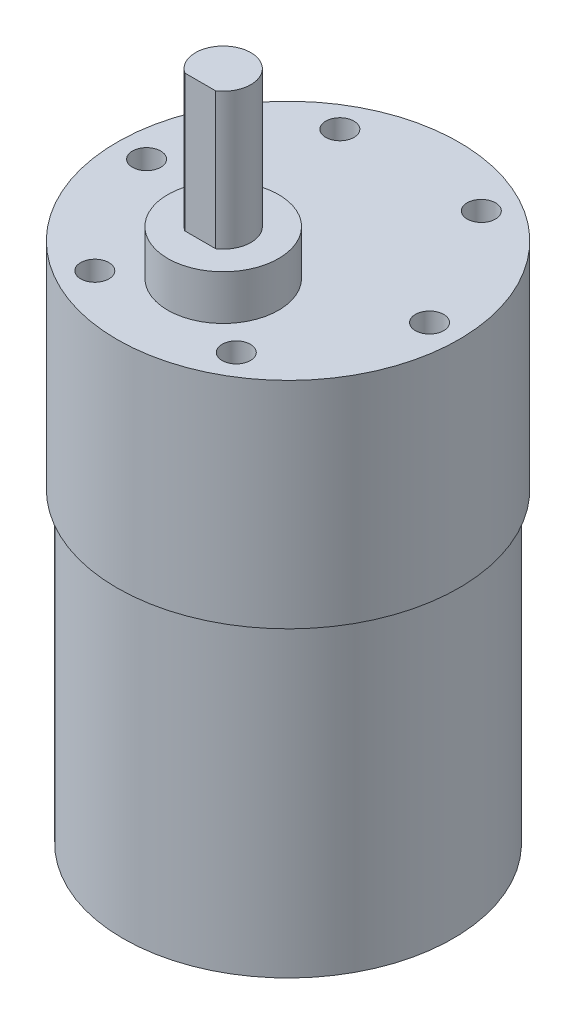
ISO-10303-21;
HEADER;
FILE_DESCRIPTION(('STEP AP214'),'2;1');
FILE_NAME('part.step','',(''),(''),'','','');
FILE_SCHEMA(('AUTOMOTIVE_DESIGN { 1 0 10303 214 1 1 1 1 }'));
ENDSEC;
DATA;
#1=APPLICATION_CONTEXT('core data for automotive mechanical design processes');
#2=APPLICATION_PROTOCOL_DEFINITION('international standard','automotive_design',2000,#1);
#3=PRODUCT_CONTEXT('',#1,'mechanical');
#4=PRODUCT('Part','Part','',(#3));
#5=PRODUCT_RELATED_PRODUCT_CATEGORY('part','',(#4));
#6=PRODUCT_DEFINITION_FORMATION('','',#4);
#7=PRODUCT_DEFINITION_CONTEXT('part definition',#1,'design');
#8=PRODUCT_DEFINITION('design','',#6,#7);
#9=PRODUCT_DEFINITION_SHAPE('','',#8);
#10=(LENGTH_UNIT() NAMED_UNIT(*) SI_UNIT(.MILLI.,.METRE.));
#11=(NAMED_UNIT(*) PLANE_ANGLE_UNIT() SI_UNIT($,.RADIAN.));
#12=(NAMED_UNIT(*) SI_UNIT($,.STERADIAN.) SOLID_ANGLE_UNIT());
#13=UNCERTAINTY_MEASURE_WITH_UNIT(LENGTH_MEASURE(1.E-05),#10,'distance_accuracy_value','');
#14=(GEOMETRIC_REPRESENTATION_CONTEXT(3) GLOBAL_UNCERTAINTY_ASSIGNED_CONTEXT((#13)) GLOBAL_UNIT_ASSIGNED_CONTEXT((#10,
#11,#12)) REPRESENTATION_CONTEXT('',''));
#15=CARTESIAN_POINT('',(0.,0.,0.));
#16=DIRECTION('',(0.,0.,1.));
#17=DIRECTION('',(1.,0.,0.));
#18=AXIS2_PLACEMENT_3D('',#15,#16,#17);
#19=CARTESIAN_POINT('',(0.,61.0235,6.985));
#20=DIRECTION('',(0.,1.,0.));
#21=DIRECTION('',(0.,0.,1.));
#22=AXIS2_PLACEMENT_3D('',#19,#20,#21);
#23=PLANE('',#22);
#24=CARTESIAN_POINT('',(0.,61.0235,6.985));
#25=DIRECTION('',(0.,1.,0.));
#26=DIRECTION('',(0.,0.,1.));
#27=AXIS2_PLACEMENT_3D('',#24,#25,#26);
#28=CIRCLE('',#27,5.969);
#29=CARTESIAN_POINT('',(0.,61.0235,12.954));
#30=VERTEX_POINT('',#29);
#31=EDGE_CURVE('E80',#30,#30,#28,.T.);
#32=ORIENTED_EDGE('',*,*,#31,.T.);
#33=EDGE_LOOP('',(#32));
#34=FACE_BOUND('',#33,.T.);
#35=CARTESIAN_POINT('',(0.,61.0235,6.985));
#36=DIRECTION('',(0.,1.,0.));
#37=DIRECTION('',(0.,0.,1.));
#38=AXIS2_PLACEMENT_3D('',#35,#36,#37);
#39=CIRCLE('',#38,2.9845);
#40=CARTESIAN_POINT('',(1.66558938517271,61.0235,9.4615));
#41=VERTEX_POINT('',#40);
#42=CARTESIAN_POINT('',(-1.66558938517271,61.0235,9.4615));
#43=VERTEX_POINT('',#42);
#44=EDGE_CURVE('E48',#41,#43,#39,.T.);
#45=ORIENTED_EDGE('',*,*,#44,.F.);
#46=DIRECTION('',(-1.,0.,0.));
#47=VECTOR('',#46,1.);
#48=CARTESIAN_POINT('',(0.,61.0235,9.4615));
#49=LINE('',#48,#47);
#50=EDGE_CURVE('E62',#41,#43,#49,.T.);
#51=ORIENTED_EDGE('',*,*,#50,.T.);
#52=EDGE_LOOP('',(#45,#51));
#53=FACE_BOUND('',#52,.T.);
#54=ADVANCED_FACE('F34',(#34,#53),#23,.T.);
#55=CARTESIAN_POINT('',(0.,33.02,0.));
#56=DIRECTION('',(0.,-1.,0.));
#57=DIRECTION('',(0.,0.,-1.));
#58=AXIS2_PLACEMENT_3D('',#55,#56,#57);
#59=CYLINDRICAL_SURFACE('',#58,17.78);
#60=CARTESIAN_POINT('',(0.,33.02,0.));
#61=DIRECTION('',(0.,1.,0.));
#62=DIRECTION('',(0.,0.,1.));
#63=AXIS2_PLACEMENT_3D('',#60,#61,#62);
#64=CIRCLE('',#63,17.78);
#65=CARTESIAN_POINT('',(0.,33.02,17.78));
#66=VERTEX_POINT('',#65);
#67=EDGE_CURVE('E11',#66,#66,#64,.T.);
#68=ORIENTED_EDGE('',*,*,#67,.F.);
#69=EDGE_LOOP('',(#68));
#70=FACE_BOUND('',#69,.T.);
#71=CARTESIAN_POINT('',(0.,0.,0.));
#72=DIRECTION('',(0.,1.,0.));
#73=DIRECTION('',(0.,0.,1.));
#74=AXIS2_PLACEMENT_3D('',#71,#72,#73);
#75=CIRCLE('',#74,17.78);
#76=CARTESIAN_POINT('',(0.,0.,17.78));
#77=VERTEX_POINT('',#76);
#78=EDGE_CURVE('E38',#77,#77,#75,.T.);
#79=ORIENTED_EDGE('',*,*,#78,.T.);
#80=EDGE_LOOP('',(#79));
#81=FACE_BOUND('',#80,.T.);
#82=ADVANCED_FACE('F36',(#70,#81),#59,.T.);
#83=CARTESIAN_POINT('',(0.,0.,0.));
#84=DIRECTION('',(0.,1.,0.));
#85=DIRECTION('',(0.,0.,1.));
#86=AXIS2_PLACEMENT_3D('',#83,#84,#85);
#87=PLANE('',#86);
#88=ORIENTED_EDGE('',*,*,#78,.F.);
#89=EDGE_LOOP('',(#88));
#90=FACE_BOUND('',#89,.T.);
#91=ADVANCED_FACE('F152',(#90),#87,.F.);
#92=CARTESIAN_POINT('',(0.,56.1975,0.));
#93=DIRECTION('',(0.,-1.,0.));
#94=DIRECTION('',(0.,0.,-1.));
#95=AXIS2_PLACEMENT_3D('',#92,#93,#94);
#96=CYLINDRICAL_SURFACE('',#95,18.415);
#97=CARTESIAN_POINT('',(0.,56.1975,0.));
#98=DIRECTION('',(0.,1.,0.));
#99=DIRECTION('',(0.,0.,1.));
#100=AXIS2_PLACEMENT_3D('',#97,#98,#99);
#101=CIRCLE('',#100,18.415);
#102=CARTESIAN_POINT('',(0.,56.1975,18.415));
#103=VERTEX_POINT('',#102);
#104=EDGE_CURVE('E122',#103,#103,#101,.T.);
#105=ORIENTED_EDGE('',*,*,#104,.F.);
#106=EDGE_LOOP('',(#105));
#107=FACE_BOUND('',#106,.T.);
#108=CARTESIAN_POINT('',(0.,33.02,0.));
#109=DIRECTION('',(0.,1.,0.));
#110=DIRECTION('',(0.,0.,1.));
#111=AXIS2_PLACEMENT_3D('',#108,#109,#110);
#112=CIRCLE('',#111,18.415);
#113=CARTESIAN_POINT('',(0.,33.02,18.415));
#114=VERTEX_POINT('',#113);
#115=EDGE_CURVE('E89',#114,#114,#112,.T.);
#116=ORIENTED_EDGE('',*,*,#115,.T.);
#117=EDGE_LOOP('',(#116));
#118=FACE_BOUND('',#117,.T.);
#119=ADVANCED_FACE('F128',(#107,#118),#96,.T.);
#120=CARTESIAN_POINT('',(0.,56.1975,0.));
#121=DIRECTION('',(0.,1.,0.));
#122=DIRECTION('',(0.,0.,1.));
#123=AXIS2_PLACEMENT_3D('',#120,#121,#122);
#124=PLANE('',#123);
#125=CARTESIAN_POINT('',(0.,56.1975,6.985));
#126=DIRECTION('',(0.,1.,0.));
#127=DIRECTION('',(0.,0.,1.));
#128=AXIS2_PLACEMENT_3D('',#125,#126,#127);
#129=CIRCLE('',#128,5.969);
#130=CARTESIAN_POINT('',(0.,56.1975,12.954));
#131=VERTEX_POINT('',#130);
#132=EDGE_CURVE('E79',#131,#131,#129,.T.);
#133=ORIENTED_EDGE('',*,*,#132,.F.);
#134=EDGE_LOOP('',(#133));
#135=FACE_BOUND('',#134,.T.);
#136=CARTESIAN_POINT('',(15.24,56.1975,0.));
#137=DIRECTION('',(0.,1.,0.));
#138=DIRECTION('',(0.,0.,1.));
#139=AXIS2_PLACEMENT_3D('',#136,#137,#138);
#140=CIRCLE('',#139,1.524);
#141=CARTESIAN_POINT('',(15.24,56.1975,1.524));
#142=VERTEX_POINT('',#141);
#143=EDGE_CURVE('E90',#142,#142,#140,.T.);
#144=ORIENTED_EDGE('',*,*,#143,.F.);
#145=EDGE_LOOP('',(#144));
#146=FACE_BOUND('',#145,.T.);
#147=CARTESIAN_POINT('',(7.62000000000015,56.1975,-13.1982271536748));
#148=DIRECTION('',(0.,1.,0.));
#149=DIRECTION('',(0.,0.,1.));
#150=AXIS2_PLACEMENT_3D('',#147,#148,#149);
#151=CIRCLE('',#150,1.524);
#152=CARTESIAN_POINT('',(7.62000000000015,56.1975,-11.6742271536748));
#153=VERTEX_POINT('',#152);
#154=EDGE_CURVE('E83',#153,#153,#151,.T.);
#155=ORIENTED_EDGE('',*,*,#154,.F.);
#156=EDGE_LOOP('',(#155));
#157=FACE_BOUND('',#156,.T.);
#158=CARTESIAN_POINT('',(-7.61999999999988,56.1975,-13.1982271536749));
#159=DIRECTION('',(0.,1.,0.));
#160=DIRECTION('',(0.,0.,1.));
#161=AXIS2_PLACEMENT_3D('',#158,#159,#160);
#162=CIRCLE('',#161,1.524);
#163=CARTESIAN_POINT('',(-7.61999999999988,56.1975,-11.6742271536749));
#164=VERTEX_POINT('',#163);
#165=EDGE_CURVE('E97',#164,#164,#162,.T.);
#166=ORIENTED_EDGE('',*,*,#165,.F.);
#167=EDGE_LOOP('',(#166));
#168=FACE_BOUND('',#167,.T.);
#169=CARTESIAN_POINT('',(-15.24,56.1975,-1.06420351207939E-13));
#170=DIRECTION('',(0.,1.,0.));
#171=DIRECTION('',(0.,0.,1.));
#172=AXIS2_PLACEMENT_3D('',#169,#170,#171);
#173=CIRCLE('',#172,1.524);
#174=CARTESIAN_POINT('',(-15.24,56.1975,1.52399999999989));
#175=VERTEX_POINT('',#174);
#176=EDGE_CURVE('E114',#175,#175,#173,.T.);
#177=ORIENTED_EDGE('',*,*,#176,.F.);
#178=EDGE_LOOP('',(#177));
#179=FACE_BOUND('',#178,.T.);
#180=CARTESIAN_POINT('',(-7.62000000000006,56.1975,13.1982271536748));
#181=DIRECTION('',(0.,1.,0.));
#182=DIRECTION('',(0.,0.,1.));
#183=AXIS2_PLACEMENT_3D('',#180,#181,#182);
#184=CIRCLE('',#183,1.524);
#185=CARTESIAN_POINT('',(-7.62000000000006,56.1975,14.7222271536748));
#186=VERTEX_POINT('',#185);
#187=EDGE_CURVE('E108',#186,#186,#184,.T.);
#188=ORIENTED_EDGE('',*,*,#187,.F.);
#189=EDGE_LOOP('',(#188));
#190=FACE_BOUND('',#189,.T.);
#191=CARTESIAN_POINT('',(7.61999999999997,56.1975,13.1982271536749));
#192=DIRECTION('',(0.,1.,0.));
#193=DIRECTION('',(0.,0.,1.));
#194=AXIS2_PLACEMENT_3D('',#191,#192,#193);
#195=CIRCLE('',#194,1.524);
#196=CARTESIAN_POINT('',(7.61999999999997,56.1975,14.7222271536749));
#197=VERTEX_POINT('',#196);
#198=EDGE_CURVE('E102',#197,#197,#195,.T.);
#199=ORIENTED_EDGE('',*,*,#198,.F.);
#200=EDGE_LOOP('',(#199));
#201=FACE_BOUND('',#200,.T.);
#202=ORIENTED_EDGE('',*,*,#104,.T.);
#203=EDGE_LOOP('',(#202));
#204=FACE_BOUND('',#203,.T.);
#205=ADVANCED_FACE('F133',(#135,#146,#157,#168,#179,#190,#201,#204),#124,.T.);
#206=CARTESIAN_POINT('',(0.,33.02,0.));
#207=DIRECTION('',(0.,1.,0.));
#208=DIRECTION('',(0.,0.,1.));
#209=AXIS2_PLACEMENT_3D('',#206,#207,#208);
#210=PLANE('',#209);
#211=ORIENTED_EDGE('',*,*,#67,.T.);
#212=EDGE_LOOP('',(#211));
#213=FACE_BOUND('',#212,.T.);
#214=ORIENTED_EDGE('',*,*,#115,.F.);
#215=EDGE_LOOP('',(#214));
#216=FACE_BOUND('',#215,.T.);
#217=ADVANCED_FACE('F130',(#213,#216),#210,.F.);
#218=CARTESIAN_POINT('',(7.61999999999997,43.4975,13.1982271536749));
#219=DIRECTION('',(0.,1.,0.));
#220=DIRECTION('',(0.,0.,1.));
#221=AXIS2_PLACEMENT_3D('',#218,#219,#220);
#222=CYLINDRICAL_SURFACE('',#221,1.524);
#223=CARTESIAN_POINT('',(7.61999999999997,43.4975,13.1982271536749));
#224=DIRECTION('',(0.,1.,0.));
#225=DIRECTION('',(0.,0.,1.));
#226=AXIS2_PLACEMENT_3D('',#223,#224,#225);
#227=CIRCLE('',#226,1.524);
#228=CARTESIAN_POINT('',(7.61999999999997,43.4975,14.7222271536749));
#229=VERTEX_POINT('',#228);
#230=EDGE_CURVE('E93',#229,#229,#227,.T.);
#231=ORIENTED_EDGE('',*,*,#230,.F.);
#232=EDGE_LOOP('',(#231));
#233=FACE_BOUND('',#232,.T.);
#234=ORIENTED_EDGE('',*,*,#198,.T.);
#235=EDGE_LOOP('',(#234));
#236=FACE_BOUND('',#235,.T.);
#237=ADVANCED_FACE('F132',(#233,#236),#222,.F.);
#238=CARTESIAN_POINT('',(7.61999999999997,43.4975,13.1982271536749));
#239=DIRECTION('',(0.,1.,0.));
#240=DIRECTION('',(0.,0.,1.));
#241=AXIS2_PLACEMENT_3D('',#238,#239,#240);
#242=PLANE('',#241);
#243=ORIENTED_EDGE('',*,*,#230,.T.);
#244=EDGE_LOOP('',(#243));
#245=FACE_BOUND('',#244,.T.);
#246=ADVANCED_FACE('F140',(#245),#242,.T.);
#247=CARTESIAN_POINT('',(-7.62000000000006,43.4975,13.1982271536748));
#248=DIRECTION('',(0.,1.,0.));
#249=DIRECTION('',(0.,0.,1.));
#250=AXIS2_PLACEMENT_3D('',#247,#248,#249);
#251=CYLINDRICAL_SURFACE('',#250,1.524);
#252=CARTESIAN_POINT('',(-7.62000000000006,43.4975,13.1982271536748));
#253=DIRECTION('',(0.,1.,0.));
#254=DIRECTION('',(0.,0.,1.));
#255=AXIS2_PLACEMENT_3D('',#252,#253,#254);
#256=CIRCLE('',#255,1.524);
#257=CARTESIAN_POINT('',(-7.62000000000006,43.4975,14.7222271536748));
#258=VERTEX_POINT('',#257);
#259=EDGE_CURVE('E105',#258,#258,#256,.T.);
#260=ORIENTED_EDGE('',*,*,#259,.F.);
#261=EDGE_LOOP('',(#260));
#262=FACE_BOUND('',#261,.T.);
#263=ORIENTED_EDGE('',*,*,#187,.T.);
#264=EDGE_LOOP('',(#263));
#265=FACE_BOUND('',#264,.T.);
#266=ADVANCED_FACE('F179',(#262,#265),#251,.F.);
#267=CARTESIAN_POINT('',(-7.62000000000006,43.4975,13.1982271536748));
#268=DIRECTION('',(0.,1.,0.));
#269=DIRECTION('',(0.,0.,1.));
#270=AXIS2_PLACEMENT_3D('',#267,#268,#269);
#271=PLANE('',#270);
#272=ORIENTED_EDGE('',*,*,#259,.T.);
#273=EDGE_LOOP('',(#272));
#274=FACE_BOUND('',#273,.T.);
#275=ADVANCED_FACE('F182',(#274),#271,.T.);
#276=CARTESIAN_POINT('',(-15.24,43.4975,-1.06420351207939E-13));
#277=DIRECTION('',(0.,1.,0.));
#278=DIRECTION('',(0.,0.,1.));
#279=AXIS2_PLACEMENT_3D('',#276,#277,#278);
#280=CYLINDRICAL_SURFACE('',#279,1.524);
#281=CARTESIAN_POINT('',(-15.24,43.4975,-1.06420351207939E-13));
#282=DIRECTION('',(0.,1.,0.));
#283=DIRECTION('',(0.,0.,1.));
#284=AXIS2_PLACEMENT_3D('',#281,#282,#283);
#285=CIRCLE('',#284,1.524);
#286=CARTESIAN_POINT('',(-15.24,43.4975,1.52399999999989));
#287=VERTEX_POINT('',#286);
#288=EDGE_CURVE('E111',#287,#287,#285,.T.);
#289=ORIENTED_EDGE('',*,*,#288,.F.);
#290=EDGE_LOOP('',(#289));
#291=FACE_BOUND('',#290,.T.);
#292=ORIENTED_EDGE('',*,*,#176,.T.);
#293=EDGE_LOOP('',(#292));
#294=FACE_BOUND('',#293,.T.);
#295=ADVANCED_FACE('F185',(#291,#294),#280,.F.);
#296=CARTESIAN_POINT('',(-15.24,43.4975,-1.06420351207939E-13));
#297=DIRECTION('',(0.,1.,0.));
#298=DIRECTION('',(0.,0.,1.));
#299=AXIS2_PLACEMENT_3D('',#296,#297,#298);
#300=PLANE('',#299);
#301=ORIENTED_EDGE('',*,*,#288,.T.);
#302=EDGE_LOOP('',(#301));
#303=FACE_BOUND('',#302,.T.);
#304=ADVANCED_FACE('F190',(#303),#300,.T.);
#305=CARTESIAN_POINT('',(-7.61999999999988,43.4975,-13.1982271536749));
#306=DIRECTION('',(0.,1.,0.));
#307=DIRECTION('',(0.,0.,1.));
#308=AXIS2_PLACEMENT_3D('',#305,#306,#307);
#309=CYLINDRICAL_SURFACE('',#308,1.524);
#310=CARTESIAN_POINT('',(-7.61999999999988,43.4975,-13.1982271536749));
#311=DIRECTION('',(0.,1.,0.));
#312=DIRECTION('',(0.,0.,1.));
#313=AXIS2_PLACEMENT_3D('',#310,#311,#312);
#314=CIRCLE('',#313,1.524);
#315=CARTESIAN_POINT('',(-7.61999999999988,43.4975,-11.6742271536749));
#316=VERTEX_POINT('',#315);
#317=EDGE_CURVE('E117',#316,#316,#314,.T.);
#318=ORIENTED_EDGE('',*,*,#317,.F.);
#319=EDGE_LOOP('',(#318));
#320=FACE_BOUND('',#319,.T.);
#321=ORIENTED_EDGE('',*,*,#165,.T.);
#322=EDGE_LOOP('',(#321));
#323=FACE_BOUND('',#322,.T.);
#324=ADVANCED_FACE('F193',(#320,#323),#309,.F.);
#325=CARTESIAN_POINT('',(-7.61999999999988,43.4975,-13.1982271536749));
#326=DIRECTION('',(0.,1.,0.));
#327=DIRECTION('',(0.,0.,1.));
#328=AXIS2_PLACEMENT_3D('',#325,#326,#327);
#329=PLANE('',#328);
#330=ORIENTED_EDGE('',*,*,#317,.T.);
#331=EDGE_LOOP('',(#330));
#332=FACE_BOUND('',#331,.T.);
#333=ADVANCED_FACE('F176',(#332),#329,.T.);
#334=CARTESIAN_POINT('',(7.62000000000015,43.4975,-13.1982271536748));
#335=DIRECTION('',(0.,1.,0.));
#336=DIRECTION('',(0.,0.,1.));
#337=AXIS2_PLACEMENT_3D('',#334,#335,#336);
#338=CYLINDRICAL_SURFACE('',#337,1.524);
#339=CARTESIAN_POINT('',(7.62000000000015,43.4975,-13.1982271536748));
#340=DIRECTION('',(0.,1.,0.));
#341=DIRECTION('',(0.,0.,1.));
#342=AXIS2_PLACEMENT_3D('',#339,#340,#341);
#343=CIRCLE('',#342,1.524);
#344=CARTESIAN_POINT('',(7.62000000000015,43.4975,-11.6742271536748));
#345=VERTEX_POINT('',#344);
#346=EDGE_CURVE('E94',#345,#345,#343,.T.);
#347=ORIENTED_EDGE('',*,*,#346,.F.);
#348=EDGE_LOOP('',(#347));
#349=FACE_BOUND('',#348,.T.);
#350=ORIENTED_EDGE('',*,*,#154,.T.);
#351=EDGE_LOOP('',(#350));
#352=FACE_BOUND('',#351,.T.);
#353=ADVANCED_FACE('F172',(#349,#352),#338,.F.);
#354=CARTESIAN_POINT('',(7.62000000000015,43.4975,-13.1982271536748));
#355=DIRECTION('',(0.,1.,0.));
#356=DIRECTION('',(0.,0.,1.));
#357=AXIS2_PLACEMENT_3D('',#354,#355,#356);
#358=PLANE('',#357);
#359=ORIENTED_EDGE('',*,*,#346,.T.);
#360=EDGE_LOOP('',(#359));
#361=FACE_BOUND('',#360,.T.);
#362=ADVANCED_FACE('F168',(#361),#358,.T.);
#363=CARTESIAN_POINT('',(15.24,43.4975,0.));
#364=DIRECTION('',(0.,1.,0.));
#365=DIRECTION('',(0.,0.,1.));
#366=AXIS2_PLACEMENT_3D('',#363,#364,#365);
#367=CYLINDRICAL_SURFACE('',#366,1.524);
#368=CARTESIAN_POINT('',(15.24,43.4975,0.));
#369=DIRECTION('',(0.,1.,0.));
#370=DIRECTION('',(0.,0.,1.));
#371=AXIS2_PLACEMENT_3D('',#368,#369,#370);
#372=CIRCLE('',#371,1.524);
#373=CARTESIAN_POINT('',(15.24,43.4975,1.524));
#374=VERTEX_POINT('',#373);
#375=EDGE_CURVE('E86',#374,#374,#372,.T.);
#376=ORIENTED_EDGE('',*,*,#375,.F.);
#377=EDGE_LOOP('',(#376));
#378=FACE_BOUND('',#377,.T.);
#379=ORIENTED_EDGE('',*,*,#143,.T.);
#380=EDGE_LOOP('',(#379));
#381=FACE_BOUND('',#380,.T.);
#382=ADVANCED_FACE('F164',(#378,#381),#367,.F.);
#383=CARTESIAN_POINT('',(15.24,43.4975,0.));
#384=DIRECTION('',(0.,1.,0.));
#385=DIRECTION('',(0.,0.,1.));
#386=AXIS2_PLACEMENT_3D('',#383,#384,#385);
#387=PLANE('',#386);
#388=ORIENTED_EDGE('',*,*,#375,.T.);
#389=EDGE_LOOP('',(#388));
#390=FACE_BOUND('',#389,.T.);
#391=ADVANCED_FACE('F160',(#390),#387,.T.);
#392=CARTESIAN_POINT('',(0.,61.0235,6.985));
#393=DIRECTION('',(0.,-1.,0.));
#394=DIRECTION('',(0.,0.,-1.));
#395=AXIS2_PLACEMENT_3D('',#392,#393,#394);
#396=CYLINDRICAL_SURFACE('',#395,5.969);
#397=ORIENTED_EDGE('',*,*,#31,.F.);
#398=EDGE_LOOP('',(#397));
#399=FACE_BOUND('',#398,.T.);
#400=ORIENTED_EDGE('',*,*,#132,.T.);
#401=EDGE_LOOP('',(#400));
#402=FACE_BOUND('',#401,.T.);
#403=ADVANCED_FACE('F157',(#399,#402),#396,.T.);
#404=CARTESIAN_POINT('',(0.,75.7555,9.4615));
#405=DIRECTION('',(0.,0.,1.));
#406=DIRECTION('',(1.,0.,0.));
#407=AXIS2_PLACEMENT_3D('',#404,#405,#406);
#408=PLANE('',#407);
#409=ORIENTED_EDGE('',*,*,#50,.F.);
#410=DIRECTION('',(0.,-1.,0.));
#411=VECTOR('',#410,1.);
#412=CARTESIAN_POINT('',(1.66558938517271,75.7555,9.4615));
#413=LINE('',#412,#411);
#414=CARTESIAN_POINT('',(1.66558938517271,75.7555,9.4615));
#415=VERTEX_POINT('',#414);
#416=EDGE_CURVE('E71',#415,#41,#413,.T.);
#417=ORIENTED_EDGE('',*,*,#416,.F.);
#418=DIRECTION('',(-1.,0.,0.));
#419=VECTOR('',#418,1.);
#420=CARTESIAN_POINT('',(0.,75.7555,9.4615));
#421=LINE('',#420,#419);
#422=CARTESIAN_POINT('',(-1.66558938517271,75.7555,9.4615));
#423=VERTEX_POINT('',#422);
#424=EDGE_CURVE('E69',#415,#423,#421,.T.);
#425=ORIENTED_EDGE('',*,*,#424,.T.);
#426=DIRECTION('',(0.,-1.,0.));
#427=VECTOR('',#426,1.);
#428=CARTESIAN_POINT('',(-1.66558938517271,75.7555,9.4615));
#429=LINE('',#428,#427);
#430=EDGE_CURVE('E67',#423,#43,#429,.T.);
#431=ORIENTED_EDGE('',*,*,#430,.T.);
#432=EDGE_LOOP('',(#409,#417,#425,#431));
#433=FACE_BOUND('',#432,.T.);
#434=ADVANCED_FACE('F68',(#433),#408,.T.);
#435=CARTESIAN_POINT('',(0.,75.7555,6.985));
#436=DIRECTION('',(0.,-1.,0.));
#437=DIRECTION('',(0.,0.,-1.));
#438=AXIS2_PLACEMENT_3D('',#435,#436,#437);
#439=CYLINDRICAL_SURFACE('',#438,2.9845);
#440=ORIENTED_EDGE('',*,*,#44,.T.);
#441=ORIENTED_EDGE('',*,*,#430,.F.);
#442=CARTESIAN_POINT('',(0.,75.7555,6.985));
#443=DIRECTION('',(0.,1.,0.));
#444=DIRECTION('',(0.,0.,1.));
#445=AXIS2_PLACEMENT_3D('',#442,#443,#444);
#446=CIRCLE('',#445,2.9845);
#447=EDGE_CURVE('E56',#415,#423,#446,.T.);
#448=ORIENTED_EDGE('',*,*,#447,.F.);
#449=ORIENTED_EDGE('',*,*,#416,.T.);
#450=EDGE_LOOP('',(#440,#441,#448,#449));
#451=FACE_BOUND('',#450,.T.);
#452=ADVANCED_FACE('F73',(#451),#439,.T.);
#453=CARTESIAN_POINT('',(0.,75.7555,0.));
#454=DIRECTION('',(0.,1.,0.));
#455=DIRECTION('',(0.,0.,1.));
#456=AXIS2_PLACEMENT_3D('',#453,#454,#455);
#457=PLANE('',#456);
#458=ORIENTED_EDGE('',*,*,#424,.F.);
#459=ORIENTED_EDGE('',*,*,#447,.T.);
#460=EDGE_LOOP('',(#458,#459));
#461=FACE_BOUND('',#460,.T.);
#462=ADVANCED_FACE('F331',(#461),#457,.T.);
#463=CLOSED_SHELL('',(#54,#82,#91,#119,#205,#217,#237,#246,#266,#275,#295,#304,#324,#333,#353,
#362,#382,#391,#403,#434,#452,#462));
#464=MANIFOLD_SOLID_BREP('B2',#463);
#465=ADVANCED_BREP_SHAPE_REPRESENTATION('',(#18,#464),#14);
#466=SHAPE_DEFINITION_REPRESENTATION(#9,#465);
ENDSEC;
END-ISO-10303-21;
